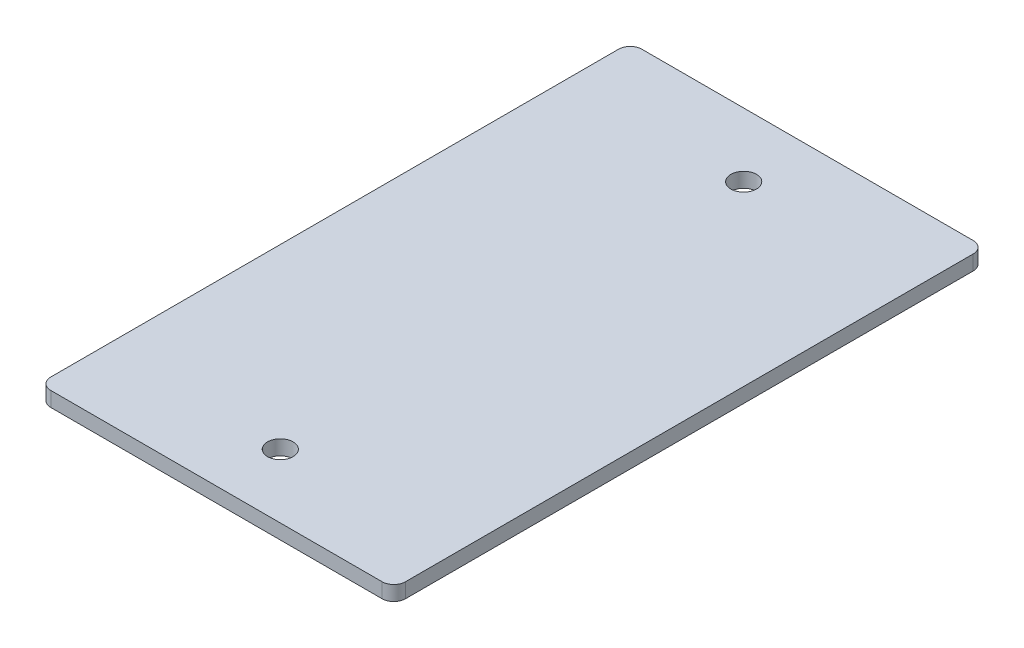
ISO-10303-21;
HEADER;
FILE_DESCRIPTION(('STEP AP214'),'2;1');
FILE_NAME('part.step','',(''),(''),'','','');
FILE_SCHEMA(('AUTOMOTIVE_DESIGN { 1 0 10303 214 1 1 1 1 }'));
ENDSEC;
DATA;
#1=APPLICATION_CONTEXT('core data for automotive mechanical design processes');
#2=APPLICATION_PROTOCOL_DEFINITION('international standard','automotive_design',2000,#1);
#3=PRODUCT_CONTEXT('',#1,'mechanical');
#4=PRODUCT('Part','Part','',(#3));
#5=PRODUCT_RELATED_PRODUCT_CATEGORY('part','',(#4));
#6=PRODUCT_DEFINITION_FORMATION('','',#4);
#7=PRODUCT_DEFINITION_CONTEXT('part definition',#1,'design');
#8=PRODUCT_DEFINITION('design','',#6,#7);
#9=PRODUCT_DEFINITION_SHAPE('','',#8);
#10=(LENGTH_UNIT() NAMED_UNIT(*) SI_UNIT(.MILLI.,.METRE.));
#11=(NAMED_UNIT(*) PLANE_ANGLE_UNIT() SI_UNIT($,.RADIAN.));
#12=(NAMED_UNIT(*) SI_UNIT($,.STERADIAN.) SOLID_ANGLE_UNIT());
#13=UNCERTAINTY_MEASURE_WITH_UNIT(LENGTH_MEASURE(1.E-05),#10,'distance_accuracy_value','');
#14=(GEOMETRIC_REPRESENTATION_CONTEXT(3) GLOBAL_UNCERTAINTY_ASSIGNED_CONTEXT((#13)) GLOBAL_UNIT_ASSIGNED_CONTEXT((#10,
#11,#12)) REPRESENTATION_CONTEXT('',''));
#15=CARTESIAN_POINT('',(0.,0.,0.));
#16=DIRECTION('',(0.,0.,1.));
#17=DIRECTION('',(1.,0.,0.));
#18=AXIS2_PLACEMENT_3D('',#15,#16,#17);
#19=CARTESIAN_POINT('',(0.,3.175,0.));
#20=DIRECTION('',(0.,-1.,0.));
#21=DIRECTION('',(0.,0.,-1.));
#22=AXIS2_PLACEMENT_3D('',#19,#20,#21);
#23=PLANE('',#22);
#24=DIRECTION('',(0.,0.,-1.));
#25=VECTOR('',#24,1.);
#26=CARTESIAN_POINT('',(38.1,3.175,63.5));
#27=LINE('',#26,#25);
#28=CARTESIAN_POINT('',(38.1,3.175,61.));
#29=VERTEX_POINT('',#28);
#30=CARTESIAN_POINT('',(38.1,3.175,-61.));
#31=VERTEX_POINT('',#30);
#32=EDGE_CURVE('E150',#29,#31,#27,.T.);
#33=ORIENTED_EDGE('',*,*,#32,.T.);
#34=CARTESIAN_POINT('',(35.6,3.175,-61.));
#35=DIRECTION('',(0.,-1.,0.));
#36=DIRECTION('',(0.,0.,-1.));
#37=AXIS2_PLACEMENT_3D('',#34,#35,#36);
#38=CIRCLE('',#37,2.5);
#39=CARTESIAN_POINT('',(35.6,3.175,-63.5));
#40=VERTEX_POINT('',#39);
#41=EDGE_CURVE('E174',#31,#40,#38,.F.);
#42=ORIENTED_EDGE('',*,*,#41,.T.);
#43=DIRECTION('',(-1.,0.,0.));
#44=VECTOR('',#43,1.);
#45=CARTESIAN_POINT('',(-38.1,3.175,-63.5));
#46=LINE('',#45,#44);
#47=CARTESIAN_POINT('',(-35.6,3.175,-63.5));
#48=VERTEX_POINT('',#47);
#49=EDGE_CURVE('E127',#40,#48,#46,.T.);
#50=ORIENTED_EDGE('',*,*,#49,.T.);
#51=CARTESIAN_POINT('',(-35.6,3.175,-61.));
#52=DIRECTION('',(0.,-1.,0.));
#53=DIRECTION('',(0.,0.,-1.));
#54=AXIS2_PLACEMENT_3D('',#51,#52,#53);
#55=CIRCLE('',#54,2.5);
#56=CARTESIAN_POINT('',(-38.1,3.175,-61.));
#57=VERTEX_POINT('',#56);
#58=EDGE_CURVE('E171',#48,#57,#55,.F.);
#59=ORIENTED_EDGE('',*,*,#58,.T.);
#60=DIRECTION('',(0.,0.,1.));
#61=VECTOR('',#60,1.);
#62=CARTESIAN_POINT('',(-38.1,3.175,63.5));
#63=LINE('',#62,#61);
#64=CARTESIAN_POINT('',(-38.1,3.175,61.));
#65=VERTEX_POINT('',#64);
#66=EDGE_CURVE('E186',#57,#65,#63,.T.);
#67=ORIENTED_EDGE('',*,*,#66,.T.);
#68=CARTESIAN_POINT('',(-35.6,3.175,61.));
#69=DIRECTION('',(0.,-1.,0.));
#70=DIRECTION('',(0.,0.,-1.));
#71=AXIS2_PLACEMENT_3D('',#68,#69,#70);
#72=CIRCLE('',#71,2.5);
#73=CARTESIAN_POINT('',(-35.6,3.175,63.5));
#74=VERTEX_POINT('',#73);
#75=EDGE_CURVE('E61',#65,#74,#72,.F.);
#76=ORIENTED_EDGE('',*,*,#75,.T.);
#77=DIRECTION('',(1.,0.,0.));
#78=VECTOR('',#77,1.);
#79=CARTESIAN_POINT('',(-38.1,3.175,63.5));
#80=LINE('',#79,#78);
#81=CARTESIAN_POINT('',(35.6,3.175,63.5));
#82=VERTEX_POINT('',#81);
#83=EDGE_CURVE('E152',#74,#82,#80,.T.);
#84=ORIENTED_EDGE('',*,*,#83,.T.);
#85=CARTESIAN_POINT('',(35.6,3.175,61.));
#86=DIRECTION('',(0.,-1.,0.));
#87=DIRECTION('',(0.,0.,-1.));
#88=AXIS2_PLACEMENT_3D('',#85,#86,#87);
#89=CIRCLE('',#88,2.5);
#90=EDGE_CURVE('E166',#82,#29,#89,.F.);
#91=ORIENTED_EDGE('',*,*,#90,.T.);
#92=EDGE_LOOP('',(#33,#42,#50,#59,#67,#76,#84,#91));
#93=FACE_BOUND('',#92,.T.);
#94=CARTESIAN_POINT('',(0.,3.175,-49.785));
#95=DIRECTION('',(0.,1.,0.));
#96=DIRECTION('',(0.,0.,1.));
#97=AXIS2_PLACEMENT_3D('',#94,#95,#96);
#98=CIRCLE('',#97,2.75);
#99=CARTESIAN_POINT('',(0.,3.175,-47.035));
#100=VERTEX_POINT('',#99);
#101=EDGE_CURVE('E144',#100,#100,#98,.T.);
#102=ORIENTED_EDGE('',*,*,#101,.F.);
#103=EDGE_LOOP('',(#102));
#104=FACE_BOUND('',#103,.T.);
#105=CARTESIAN_POINT('',(0.,3.175,49.785));
#106=DIRECTION('',(0.,1.,0.));
#107=DIRECTION('',(0.,0.,1.));
#108=AXIS2_PLACEMENT_3D('',#105,#106,#107);
#109=CIRCLE('',#108,2.75);
#110=CARTESIAN_POINT('',(0.,3.175,52.535));
#111=VERTEX_POINT('',#110);
#112=EDGE_CURVE('E199',#111,#111,#109,.T.);
#113=ORIENTED_EDGE('',*,*,#112,.F.);
#114=EDGE_LOOP('',(#113));
#115=FACE_BOUND('',#114,.T.);
#116=ADVANCED_FACE('F39',(#93,#104,#115),#23,.F.);
#117=CARTESIAN_POINT('',(0.,0.,0.));
#118=DIRECTION('',(0.,-1.,0.));
#119=DIRECTION('',(0.,0.,-1.));
#120=AXIS2_PLACEMENT_3D('',#117,#118,#119);
#121=PLANE('',#120);
#122=CARTESIAN_POINT('',(0.,0.,-49.785));
#123=DIRECTION('',(0.,1.,0.));
#124=DIRECTION('',(0.,0.,1.));
#125=AXIS2_PLACEMENT_3D('',#122,#123,#124);
#126=CIRCLE('',#125,2.75);
#127=CARTESIAN_POINT('',(0.,0.,-47.035));
#128=VERTEX_POINT('',#127);
#129=EDGE_CURVE('E195',#128,#128,#126,.T.);
#130=ORIENTED_EDGE('',*,*,#129,.T.);
#131=EDGE_LOOP('',(#130));
#132=FACE_BOUND('',#131,.T.);
#133=DIRECTION('',(-1.,0.,0.));
#134=VECTOR('',#133,1.);
#135=CARTESIAN_POINT('',(-38.1,0.,-63.5));
#136=LINE('',#135,#134);
#137=CARTESIAN_POINT('',(35.6,0.,-63.5));
#138=VERTEX_POINT('',#137);
#139=CARTESIAN_POINT('',(-35.6,0.,-63.5));
#140=VERTEX_POINT('',#139);
#141=EDGE_CURVE('E124',#138,#140,#136,.T.);
#142=ORIENTED_EDGE('',*,*,#141,.F.);
#143=CARTESIAN_POINT('',(35.6,0.,-61.));
#144=DIRECTION('',(0.,-1.,0.));
#145=DIRECTION('',(0.,0.,-1.));
#146=AXIS2_PLACEMENT_3D('',#143,#144,#145);
#147=CIRCLE('',#146,2.5);
#148=CARTESIAN_POINT('',(38.1,0.,-61.));
#149=VERTEX_POINT('',#148);
#150=EDGE_CURVE('E106',#138,#149,#147,.T.);
#151=ORIENTED_EDGE('',*,*,#150,.T.);
#152=DIRECTION('',(0.,0.,-1.));
#153=VECTOR('',#152,1.);
#154=CARTESIAN_POINT('',(38.1,0.,63.5));
#155=LINE('',#154,#153);
#156=CARTESIAN_POINT('',(38.1,0.,61.));
#157=VERTEX_POINT('',#156);
#158=EDGE_CURVE('E137',#157,#149,#155,.T.);
#159=ORIENTED_EDGE('',*,*,#158,.F.);
#160=CARTESIAN_POINT('',(35.6,0.,61.));
#161=DIRECTION('',(0.,-1.,0.));
#162=DIRECTION('',(0.,0.,-1.));
#163=AXIS2_PLACEMENT_3D('',#160,#161,#162);
#164=CIRCLE('',#163,2.5);
#165=CARTESIAN_POINT('',(35.6,0.,63.5));
#166=VERTEX_POINT('',#165);
#167=EDGE_CURVE('E129',#157,#166,#164,.T.);
#168=ORIENTED_EDGE('',*,*,#167,.T.);
#169=DIRECTION('',(1.,0.,0.));
#170=VECTOR('',#169,1.);
#171=CARTESIAN_POINT('',(-38.1,0.,63.5));
#172=LINE('',#171,#170);
#173=CARTESIAN_POINT('',(-35.6,0.,63.5));
#174=VERTEX_POINT('',#173);
#175=EDGE_CURVE('E142',#174,#166,#172,.T.);
#176=ORIENTED_EDGE('',*,*,#175,.F.);
#177=CARTESIAN_POINT('',(-35.6,0.,61.));
#178=DIRECTION('',(0.,-1.,0.));
#179=DIRECTION('',(0.,0.,-1.));
#180=AXIS2_PLACEMENT_3D('',#177,#178,#179);
#181=CIRCLE('',#180,2.5);
#182=CARTESIAN_POINT('',(-38.1,0.,61.));
#183=VERTEX_POINT('',#182);
#184=EDGE_CURVE('E156',#174,#183,#181,.T.);
#185=ORIENTED_EDGE('',*,*,#184,.T.);
#186=DIRECTION('',(0.,0.,1.));
#187=VECTOR('',#186,1.);
#188=CARTESIAN_POINT('',(-38.1,0.,63.5));
#189=LINE('',#188,#187);
#190=CARTESIAN_POINT('',(-38.1,0.,-61.));
#191=VERTEX_POINT('',#190);
#192=EDGE_CURVE('E136',#191,#183,#189,.T.);
#193=ORIENTED_EDGE('',*,*,#192,.F.);
#194=CARTESIAN_POINT('',(-35.6,0.,-61.));
#195=DIRECTION('',(0.,-1.,0.));
#196=DIRECTION('',(0.,0.,-1.));
#197=AXIS2_PLACEMENT_3D('',#194,#195,#196);
#198=CIRCLE('',#197,2.5);
#199=EDGE_CURVE('E118',#191,#140,#198,.T.);
#200=ORIENTED_EDGE('',*,*,#199,.T.);
#201=EDGE_LOOP('',(#142,#151,#159,#168,#176,#185,#193,#200));
#202=FACE_BOUND('',#201,.T.);
#203=CARTESIAN_POINT('',(0.,0.,49.785));
#204=DIRECTION('',(0.,1.,0.));
#205=DIRECTION('',(0.,0.,1.));
#206=AXIS2_PLACEMENT_3D('',#203,#204,#205);
#207=CIRCLE('',#206,2.75);
#208=CARTESIAN_POINT('',(0.,0.,52.535));
#209=VERTEX_POINT('',#208);
#210=EDGE_CURVE('E203',#209,#209,#207,.T.);
#211=ORIENTED_EDGE('',*,*,#210,.T.);
#212=EDGE_LOOP('',(#211));
#213=FACE_BOUND('',#212,.T.);
#214=ADVANCED_FACE('F132',(#132,#202,#213),#121,.T.);
#215=CARTESIAN_POINT('',(38.1,3.175,63.5));
#216=DIRECTION('',(-1.,0.,0.));
#217=DIRECTION('',(0.,0.,1.));
#218=AXIS2_PLACEMENT_3D('',#215,#216,#217);
#219=PLANE('',#218);
#220=ORIENTED_EDGE('',*,*,#158,.T.);
#221=DIRECTION('',(0.,-1.,0.));
#222=VECTOR('',#221,1.);
#223=CARTESIAN_POINT('',(38.1,3.175,-61.));
#224=LINE('',#223,#222);
#225=EDGE_CURVE('E111',#149,#31,#224,.F.);
#226=ORIENTED_EDGE('',*,*,#225,.T.);
#227=ORIENTED_EDGE('',*,*,#32,.F.);
#228=DIRECTION('',(0.,-1.,0.));
#229=VECTOR('',#228,1.);
#230=CARTESIAN_POINT('',(38.1,3.175,61.));
#231=LINE('',#230,#229);
#232=EDGE_CURVE('E117',#29,#157,#231,.T.);
#233=ORIENTED_EDGE('',*,*,#232,.T.);
#234=EDGE_LOOP('',(#220,#226,#227,#233));
#235=FACE_BOUND('',#234,.T.);
#236=ADVANCED_FACE('F219',(#235),#219,.F.);
#237=CARTESIAN_POINT('',(-38.1,3.175,-63.5));
#238=DIRECTION('',(0.,0.,1.));
#239=DIRECTION('',(1.,0.,0.));
#240=AXIS2_PLACEMENT_3D('',#237,#238,#239);
#241=PLANE('',#240);
#242=ORIENTED_EDGE('',*,*,#49,.F.);
#243=DIRECTION('',(0.,-1.,0.));
#244=VECTOR('',#243,1.);
#245=CARTESIAN_POINT('',(35.6,3.175,-63.5));
#246=LINE('',#245,#244);
#247=EDGE_CURVE('E110',#40,#138,#246,.T.);
#248=ORIENTED_EDGE('',*,*,#247,.T.);
#249=ORIENTED_EDGE('',*,*,#141,.T.);
#250=DIRECTION('',(0.,-1.,0.));
#251=VECTOR('',#250,1.);
#252=CARTESIAN_POINT('',(-35.6,3.175,-63.5));
#253=LINE('',#252,#251);
#254=EDGE_CURVE('E130',#140,#48,#253,.F.);
#255=ORIENTED_EDGE('',*,*,#254,.T.);
#256=EDGE_LOOP('',(#242,#248,#249,#255));
#257=FACE_BOUND('',#256,.T.);
#258=ADVANCED_FACE('F123',(#257),#241,.F.);
#259=CARTESIAN_POINT('',(-38.1,3.175,63.5));
#260=DIRECTION('',(1.,0.,0.));
#261=DIRECTION('',(0.,0.,-1.));
#262=AXIS2_PLACEMENT_3D('',#259,#260,#261);
#263=PLANE('',#262);
#264=ORIENTED_EDGE('',*,*,#66,.F.);
#265=DIRECTION('',(0.,-1.,0.));
#266=VECTOR('',#265,1.);
#267=CARTESIAN_POINT('',(-38.1,3.175,-61.));
#268=LINE('',#267,#266);
#269=EDGE_CURVE('E180',#57,#191,#268,.T.);
#270=ORIENTED_EDGE('',*,*,#269,.T.);
#271=ORIENTED_EDGE('',*,*,#192,.T.);
#272=DIRECTION('',(0.,-1.,0.));
#273=VECTOR('',#272,1.);
#274=CARTESIAN_POINT('',(-38.1,3.175,61.));
#275=LINE('',#274,#273);
#276=EDGE_CURVE('E177',#183,#65,#275,.F.);
#277=ORIENTED_EDGE('',*,*,#276,.T.);
#278=EDGE_LOOP('',(#264,#270,#271,#277));
#279=FACE_BOUND('',#278,.T.);
#280=ADVANCED_FACE('F230',(#279),#263,.F.);
#281=CARTESIAN_POINT('',(-38.1,3.175,63.5));
#282=DIRECTION('',(0.,0.,-1.));
#283=DIRECTION('',(-1.,0.,0.));
#284=AXIS2_PLACEMENT_3D('',#281,#282,#283);
#285=PLANE('',#284);
#286=ORIENTED_EDGE('',*,*,#83,.F.);
#287=DIRECTION('',(0.,-1.,0.));
#288=VECTOR('',#287,1.);
#289=CARTESIAN_POINT('',(-35.6,3.175,63.5));
#290=LINE('',#289,#288);
#291=EDGE_CURVE('E11',#74,#174,#290,.T.);
#292=ORIENTED_EDGE('',*,*,#291,.T.);
#293=ORIENTED_EDGE('',*,*,#175,.T.);
#294=DIRECTION('',(0.,-1.,0.));
#295=VECTOR('',#294,1.);
#296=CARTESIAN_POINT('',(35.6,3.175,63.5));
#297=LINE('',#296,#295);
#298=EDGE_CURVE('E48',#166,#82,#297,.F.);
#299=ORIENTED_EDGE('',*,*,#298,.T.);
#300=EDGE_LOOP('',(#286,#292,#293,#299));
#301=FACE_BOUND('',#300,.T.);
#302=ADVANCED_FACE('F227',(#301),#285,.F.);
#303=CARTESIAN_POINT('',(0.,3.175,-49.785));
#304=DIRECTION('',(0.,-1.,0.));
#305=DIRECTION('',(0.,0.,-1.));
#306=AXIS2_PLACEMENT_3D('',#303,#304,#305);
#307=CYLINDRICAL_SURFACE('',#306,2.75);
#308=ORIENTED_EDGE('',*,*,#101,.T.);
#309=EDGE_LOOP('',(#308));
#310=FACE_BOUND('',#309,.T.);
#311=ORIENTED_EDGE('',*,*,#129,.F.);
#312=EDGE_LOOP('',(#311));
#313=FACE_BOUND('',#312,.T.);
#314=ADVANCED_FACE('F224',(#310,#313),#307,.F.);
#315=CARTESIAN_POINT('',(0.,3.175,49.785));
#316=DIRECTION('',(0.,-1.,0.));
#317=DIRECTION('',(0.,0.,-1.));
#318=AXIS2_PLACEMENT_3D('',#315,#316,#317);
#319=CYLINDRICAL_SURFACE('',#318,2.75);
#320=ORIENTED_EDGE('',*,*,#112,.T.);
#321=EDGE_LOOP('',(#320));
#322=FACE_BOUND('',#321,.T.);
#323=ORIENTED_EDGE('',*,*,#210,.F.);
#324=EDGE_LOOP('',(#323));
#325=FACE_BOUND('',#324,.T.);
#326=ADVANCED_FACE('F211',(#322,#325),#319,.F.);
#327=CARTESIAN_POINT('',(35.6,3.175,-61.));
#328=DIRECTION('',(0.,-1.,0.));
#329=DIRECTION('',(0.,0.,-1.));
#330=AXIS2_PLACEMENT_3D('',#327,#328,#329);
#331=CYLINDRICAL_SURFACE('',#330,2.5);
#332=ORIENTED_EDGE('',*,*,#41,.F.);
#333=ORIENTED_EDGE('',*,*,#225,.F.);
#334=ORIENTED_EDGE('',*,*,#150,.F.);
#335=ORIENTED_EDGE('',*,*,#247,.F.);
#336=EDGE_LOOP('',(#332,#333,#334,#335));
#337=FACE_BOUND('',#336,.T.);
#338=ADVANCED_FACE('F109',(#337),#331,.T.);
#339=CARTESIAN_POINT('',(-35.6,3.175,-61.));
#340=DIRECTION('',(0.,-1.,0.));
#341=DIRECTION('',(0.,0.,-1.));
#342=AXIS2_PLACEMENT_3D('',#339,#340,#341);
#343=CYLINDRICAL_SURFACE('',#342,2.5);
#344=ORIENTED_EDGE('',*,*,#58,.F.);
#345=ORIENTED_EDGE('',*,*,#254,.F.);
#346=ORIENTED_EDGE('',*,*,#199,.F.);
#347=ORIENTED_EDGE('',*,*,#269,.F.);
#348=EDGE_LOOP('',(#344,#345,#346,#347));
#349=FACE_BOUND('',#348,.T.);
#350=ADVANCED_FACE('F241',(#349),#343,.T.);
#351=CARTESIAN_POINT('',(-35.6,3.175,61.));
#352=DIRECTION('',(0.,-1.,0.));
#353=DIRECTION('',(0.,0.,-1.));
#354=AXIS2_PLACEMENT_3D('',#351,#352,#353);
#355=CYLINDRICAL_SURFACE('',#354,2.5);
#356=ORIENTED_EDGE('',*,*,#75,.F.);
#357=ORIENTED_EDGE('',*,*,#276,.F.);
#358=ORIENTED_EDGE('',*,*,#184,.F.);
#359=ORIENTED_EDGE('',*,*,#291,.F.);
#360=EDGE_LOOP('',(#356,#357,#358,#359));
#361=FACE_BOUND('',#360,.T.);
#362=ADVANCED_FACE('F243',(#361),#355,.T.);
#363=CARTESIAN_POINT('',(35.6,3.175,61.));
#364=DIRECTION('',(0.,-1.,0.));
#365=DIRECTION('',(0.,0.,-1.));
#366=AXIS2_PLACEMENT_3D('',#363,#364,#365);
#367=CYLINDRICAL_SURFACE('',#366,2.5);
#368=ORIENTED_EDGE('',*,*,#90,.F.);
#369=ORIENTED_EDGE('',*,*,#298,.F.);
#370=ORIENTED_EDGE('',*,*,#167,.F.);
#371=ORIENTED_EDGE('',*,*,#232,.F.);
#372=EDGE_LOOP('',(#368,#369,#370,#371));
#373=FACE_BOUND('',#372,.T.);
#374=ADVANCED_FACE('F41',(#373),#367,.T.);
#375=CLOSED_SHELL('',(#116,#214,#236,#258,#280,#302,#314,#326,#338,#350,#362,#374));
#376=MANIFOLD_SOLID_BREP('B2',#375);
#377=ADVANCED_BREP_SHAPE_REPRESENTATION('',(#18,#376),#14);
#378=SHAPE_DEFINITION_REPRESENTATION(#9,#377);
ENDSEC;
END-ISO-10303-21;
